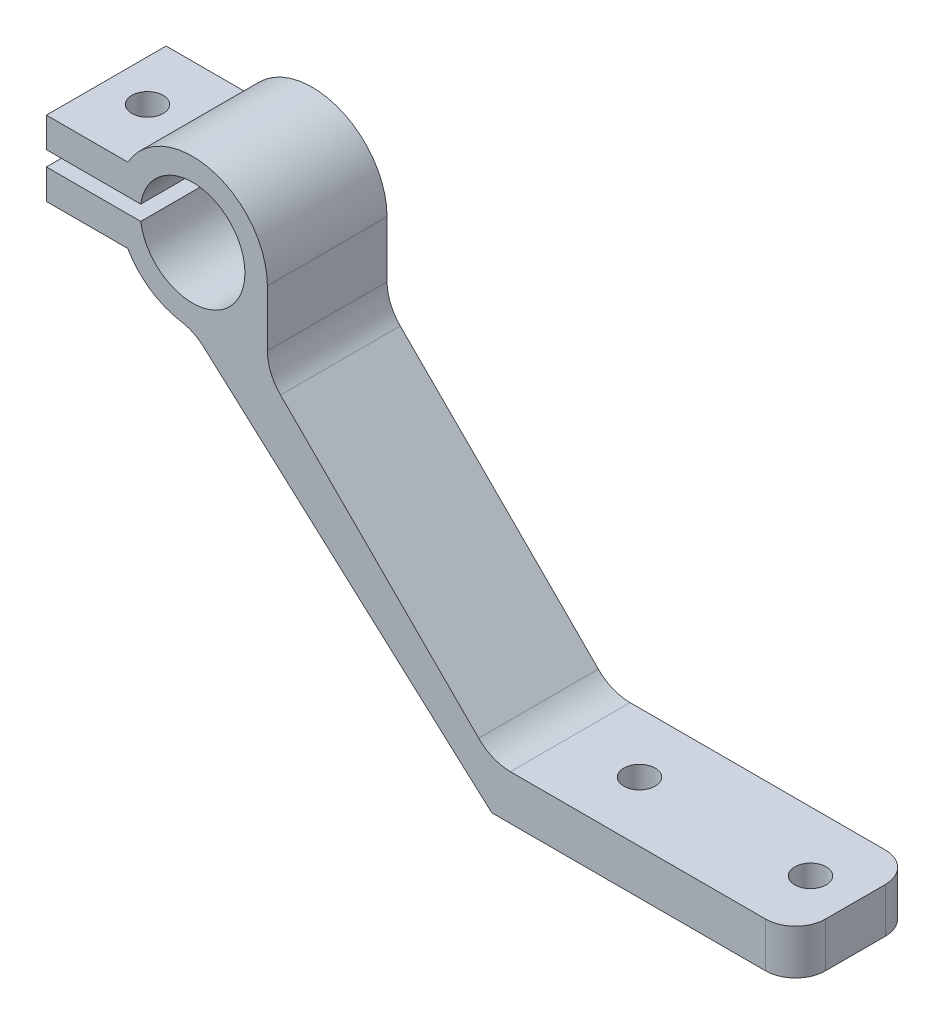
ISO-10303-21;
HEADER;
FILE_DESCRIPTION(('STEP AP214'),'2;1');
FILE_NAME('part.step','',(''),(''),'','','');
FILE_SCHEMA(('AUTOMOTIVE_DESIGN { 1 0 10303 214 1 1 1 1 }'));
ENDSEC;
DATA;
#1=APPLICATION_CONTEXT('core data for automotive mechanical design processes');
#2=APPLICATION_PROTOCOL_DEFINITION('international standard','automotive_design',2000,#1);
#3=PRODUCT_CONTEXT('',#1,'mechanical');
#4=PRODUCT('Part','Part','',(#3));
#5=PRODUCT_RELATED_PRODUCT_CATEGORY('part','',(#4));
#6=PRODUCT_DEFINITION_FORMATION('','',#4);
#7=PRODUCT_DEFINITION_CONTEXT('part definition',#1,'design');
#8=PRODUCT_DEFINITION('design','',#6,#7);
#9=PRODUCT_DEFINITION_SHAPE('','',#8);
#10=(LENGTH_UNIT() NAMED_UNIT(*) SI_UNIT(.MILLI.,.METRE.));
#11=(NAMED_UNIT(*) PLANE_ANGLE_UNIT() SI_UNIT($,.RADIAN.));
#12=(NAMED_UNIT(*) SI_UNIT($,.STERADIAN.) SOLID_ANGLE_UNIT());
#13=UNCERTAINTY_MEASURE_WITH_UNIT(LENGTH_MEASURE(1.E-05),#10,'distance_accuracy_value','');
#14=(GEOMETRIC_REPRESENTATION_CONTEXT(3) GLOBAL_UNCERTAINTY_ASSIGNED_CONTEXT((#13)) GLOBAL_UNIT_ASSIGNED_CONTEXT((#10,
#11,#12)) REPRESENTATION_CONTEXT('',''));
#15=CARTESIAN_POINT('',(0.,0.,0.));
#16=DIRECTION('',(0.,0.,1.));
#17=DIRECTION('',(1.,0.,0.));
#18=AXIS2_PLACEMENT_3D('',#15,#16,#17);
#19=CARTESIAN_POINT('',(-38.5942428896594,0.,0.));
#20=DIRECTION('',(0.,1.,0.));
#21=DIRECTION('',(0.,0.,1.));
#22=AXIS2_PLACEMENT_3D('',#19,#20,#21);
#23=CYLINDRICAL_SURFACE('',#22,1.05);
#24=CARTESIAN_POINT('',(-38.5942428896594,22.5,0.));
#25=DIRECTION('',(0.,-1.,0.));
#26=DIRECTION('',(0.,0.,-1.));
#27=AXIS2_PLACEMENT_3D('',#24,#25,#26);
#28=CIRCLE('',#27,1.05);
#29=CARTESIAN_POINT('',(-38.5942428896594,22.5,-1.05));
#30=VERTEX_POINT('',#29);
#31=EDGE_CURVE('E281',#30,#30,#28,.T.);
#32=ORIENTED_EDGE('',*,*,#31,.F.);
#33=EDGE_LOOP('',(#32));
#34=FACE_BOUND('',#33,.T.);
#35=CARTESIAN_POINT('',(-38.5942428896594,21.3,0.));
#36=DIRECTION('',(0.,-1.,0.));
#37=DIRECTION('',(0.,0.,-1.));
#38=AXIS2_PLACEMENT_3D('',#35,#36,#37);
#39=CIRCLE('',#38,1.05);
#40=CARTESIAN_POINT('',(-38.5942428896594,21.3,-1.05));
#41=VERTEX_POINT('',#40);
#42=EDGE_CURVE('E53',#41,#41,#39,.F.);
#43=ORIENTED_EDGE('',*,*,#42,.F.);
#44=EDGE_LOOP('',(#43));
#45=FACE_BOUND('',#44,.T.);
#46=ADVANCED_FACE('F49',(#34,#45),#23,.F.);
#47=CARTESIAN_POINT('',(0.,3.,4.));
#48=DIRECTION('',(0.,0.,-1.));
#49=DIRECTION('',(-1.,0.,0.));
#50=AXIS2_PLACEMENT_3D('',#47,#48,#49);
#51=PLANE('',#50);
#52=DIRECTION('',(1.,0.,0.));
#53=VECTOR('',#52,1.);
#54=CARTESIAN_POINT('',(0.,0.,4.));
#55=LINE('',#54,#53);
#56=CARTESIAN_POINT('',(-11.585,0.,4.));
#57=VERTEX_POINT('',#56);
#58=CARTESIAN_POINT('',(6.71499999999999,0.,4.));
#59=VERTEX_POINT('',#58);
#60=EDGE_CURVE('E497',#57,#59,#55,.T.);
#61=ORIENTED_EDGE('',*,*,#60,.T.);
#62=DIRECTION('',(0.,-1.,0.));
#63=VECTOR('',#62,1.);
#64=CARTESIAN_POINT('',(6.71499999999999,3.,4.));
#65=LINE('',#64,#63);
#66=CARTESIAN_POINT('',(6.71499999999999,3.,4.));
#67=VERTEX_POINT('',#66);
#68=EDGE_CURVE('E469',#67,#59,#65,.T.);
#69=ORIENTED_EDGE('',*,*,#68,.F.);
#70=DIRECTION('',(1.,0.,0.));
#71=VECTOR('',#70,1.);
#72=CARTESIAN_POINT('',(0.,3.,4.));
#73=LINE('',#72,#71);
#74=CARTESIAN_POINT('',(-10.3423593128807,3.,4.));
#75=VERTEX_POINT('',#74);
#76=EDGE_CURVE('E483',#75,#67,#73,.T.);
#77=ORIENTED_EDGE('',*,*,#76,.F.);
#78=CARTESIAN_POINT('',(-10.3423593128807,6.,4.));
#79=DIRECTION('',(0.,0.,-1.));
#80=DIRECTION('',(-1.,0.,0.));
#81=AXIS2_PLACEMENT_3D('',#78,#79,#80);
#82=CIRCLE('',#81,3.);
#83=CARTESIAN_POINT('',(-12.4636796564404,3.87867965644035,4.));
#84=VERTEX_POINT('',#83);
#85=EDGE_CURVE('E58',#75,#84,#82,.T.);
#86=ORIENTED_EDGE('',*,*,#85,.T.);
#87=DIRECTION('',(0.707106781186548,-0.707106781186547,0.));
#88=VECTOR('',#87,1.);
#89=CARTESIAN_POINT('',(-26.585,18.,4.));
#90=LINE('',#89,#88);
#91=CARTESIAN_POINT('',(-25.7063203435596,17.1213203435596,4.));
#92=VERTEX_POINT('',#91);
#93=EDGE_CURVE('E334',#92,#84,#90,.T.);
#94=ORIENTED_EDGE('',*,*,#93,.F.);
#95=CARTESIAN_POINT('',(-23.585,19.2426406871193,4.));
#96=DIRECTION('',(0.,0.,-1.));
#97=DIRECTION('',(-1.,0.,0.));
#98=AXIS2_PLACEMENT_3D('',#95,#96,#97);
#99=CIRCLE('',#98,3.);
#100=CARTESIAN_POINT('',(-26.585,19.2426406871193,4.));
#101=VERTEX_POINT('',#100);
#102=EDGE_CURVE('E376',#92,#101,#99,.T.);
#103=ORIENTED_EDGE('',*,*,#102,.T.);
#104=DIRECTION('',(0.,-1.,0.));
#105=VECTOR('',#104,1.);
#106=CARTESIAN_POINT('',(-26.585,0.,4.));
#107=LINE('',#106,#105);
#108=CARTESIAN_POINT('',(-26.585,23.,4.));
#109=VERTEX_POINT('',#108);
#110=EDGE_CURVE('E285',#109,#101,#107,.T.);
#111=ORIENTED_EDGE('',*,*,#110,.F.);
#112=CARTESIAN_POINT('',(-31.585,23.,4.));
#113=DIRECTION('',(0.,0.,1.));
#114=DIRECTION('',(1.,0.,0.));
#115=AXIS2_PLACEMENT_3D('',#112,#113,#114);
#116=CIRCLE('',#115,5.);
#117=CARTESIAN_POINT('',(-35.9151270189222,25.5,4.));
#118=VERTEX_POINT('',#117);
#119=EDGE_CURVE('E286',#109,#118,#116,.T.);
#120=ORIENTED_EDGE('',*,*,#119,.T.);
#121=DIRECTION('',(1.,0.,0.));
#122=VECTOR('',#121,1.);
#123=CARTESIAN_POINT('',(0.,25.5,4.));
#124=LINE('',#123,#122);
#125=CARTESIAN_POINT('',(-41.3546960070847,25.5,4.));
#126=VERTEX_POINT('',#125);
#127=EDGE_CURVE('E289',#126,#118,#124,.T.);
#128=ORIENTED_EDGE('',*,*,#127,.F.);
#129=DIRECTION('',(0.,1.,0.));
#130=VECTOR('',#129,1.);
#131=CARTESIAN_POINT('',(-41.3546960070847,0.,4.));
#132=LINE('',#131,#130);
#133=CARTESIAN_POINT('',(-41.3546960070847,23.5,4.));
#134=VERTEX_POINT('',#133);
#135=EDGE_CURVE('E292',#134,#126,#132,.T.);
#136=ORIENTED_EDGE('',*,*,#135,.F.);
#137=DIRECTION('',(1.,0.,0.));
#138=VECTOR('',#137,1.);
#139=CARTESIAN_POINT('',(0.,23.5,4.));
#140=LINE('',#139,#138);
#141=CARTESIAN_POINT('',(-35.0491016151378,23.5,4.));
#142=VERTEX_POINT('',#141);
#143=EDGE_CURVE('E295',#134,#142,#140,.T.);
#144=ORIENTED_EDGE('',*,*,#143,.T.);
#145=CARTESIAN_POINT('',(-31.585,23.,4.));
#146=DIRECTION('',(0.,0.,1.));
#147=DIRECTION('',(1.,0.,0.));
#148=AXIS2_PLACEMENT_3D('',#145,#146,#147);
#149=CIRCLE('',#148,3.5);
#150=CARTESIAN_POINT('',(-35.0491016151378,22.5,4.));
#151=VERTEX_POINT('',#150);
#152=EDGE_CURVE('E298',#151,#142,#149,.T.);
#153=ORIENTED_EDGE('',*,*,#152,.F.);
#154=DIRECTION('',(1.,0.,0.));
#155=VECTOR('',#154,1.);
#156=CARTESIAN_POINT('',(0.,22.5,4.));
#157=LINE('',#156,#155);
#158=CARTESIAN_POINT('',(-41.3546960070847,22.5,4.));
#159=VERTEX_POINT('',#158);
#160=EDGE_CURVE('E301',#159,#151,#157,.T.);
#161=ORIENTED_EDGE('',*,*,#160,.F.);
#162=DIRECTION('',(0.,1.,0.));
#163=VECTOR('',#162,1.);
#164=CARTESIAN_POINT('',(-41.3546960070847,0.,4.));
#165=LINE('',#164,#163);
#166=CARTESIAN_POINT('',(-41.3546960070847,20.5,4.));
#167=VERTEX_POINT('',#166);
#168=EDGE_CURVE('E304',#167,#159,#165,.T.);
#169=ORIENTED_EDGE('',*,*,#168,.F.);
#170=DIRECTION('',(1.,0.,0.));
#171=VECTOR('',#170,1.);
#172=CARTESIAN_POINT('',(0.,20.5,4.));
#173=LINE('',#172,#171);
#174=CARTESIAN_POINT('',(-35.9151270189222,20.5,4.));
#175=VERTEX_POINT('',#174);
#176=EDGE_CURVE('E307',#167,#175,#173,.T.);
#177=ORIENTED_EDGE('',*,*,#176,.T.);
#178=CARTESIAN_POINT('',(-31.585,23.,4.));
#179=DIRECTION('',(0.,0.,1.));
#180=DIRECTION('',(1.,0.,0.));
#181=AXIS2_PLACEMENT_3D('',#178,#179,#180);
#182=CIRCLE('',#181,5.);
#183=CARTESIAN_POINT('',(-32.3741338080708,18.0626659184374,4.));
#184=VERTEX_POINT('',#183);
#185=EDGE_CURVE('E310',#175,#184,#182,.T.);
#186=ORIENTED_EDGE('',*,*,#185,.T.);
#187=CARTESIAN_POINT('',(-32.8476140929133,15.1002654694998,4.));
#188=DIRECTION('',(0.,0.,-1.));
#189=DIRECTION('',(-1.,0.,0.));
#190=AXIS2_PLACEMENT_3D('',#187,#188,#189);
#191=CIRCLE('',#190,3.);
#192=CARTESIAN_POINT('',(-30.8407198980459,17.3301479082413,4.));
#193=VERTEX_POINT('',#192);
#194=EDGE_CURVE('E372',#184,#193,#191,.T.);
#195=ORIENTED_EDGE('',*,*,#194,.T.);
#196=DIRECTION('',(0.743294146247166,-0.66896473162245,0.));
#197=VECTOR('',#196,1.);
#198=CARTESIAN_POINT('',(-31.585,18.,4.));
#199=LINE('',#198,#197);
#200=EDGE_CURVE('E359',#193,#57,#199,.T.);
#201=ORIENTED_EDGE('',*,*,#200,.T.);
#202=EDGE_LOOP('',(#61,#69,#77,#86,#94,#103,#111,#120,#128,#136,#144,#153,#161,#169,#177,#186,
#195,#201));
#203=FACE_BOUND('',#202,.T.);
#204=ADVANCED_FACE('F387',(#203),#51,.F.);
#205=CARTESIAN_POINT('',(6.715,3.,2.));
#206=DIRECTION('',(0.,-1.,0.));
#207=DIRECTION('',(0.,0.,-1.));
#208=AXIS2_PLACEMENT_3D('',#205,#206,#207);
#209=CYLINDRICAL_SURFACE('',#208,2.);
#210=CARTESIAN_POINT('',(6.715,0.,2.));
#211=DIRECTION('',(0.,1.,0.));
#212=DIRECTION('',(0.,0.,1.));
#213=AXIS2_PLACEMENT_3D('',#210,#211,#212);
#214=CIRCLE('',#213,2.);
#215=CARTESIAN_POINT('',(8.715,0.,1.99999999999999));
#216=VERTEX_POINT('',#215);
#217=EDGE_CURVE('E498',#59,#216,#214,.T.);
#218=ORIENTED_EDGE('',*,*,#217,.T.);
#219=DIRECTION('',(0.,-1.,0.));
#220=VECTOR('',#219,1.);
#221=CARTESIAN_POINT('',(8.715,3.,1.99999999999999));
#222=LINE('',#221,#220);
#223=CARTESIAN_POINT('',(8.715,3.,1.99999999999999));
#224=VERTEX_POINT('',#223);
#225=EDGE_CURVE('E511',#224,#216,#222,.T.);
#226=ORIENTED_EDGE('',*,*,#225,.F.);
#227=CARTESIAN_POINT('',(6.715,3.,2.));
#228=DIRECTION('',(0.,1.,0.));
#229=DIRECTION('',(0.,0.,1.));
#230=AXIS2_PLACEMENT_3D('',#227,#228,#229);
#231=CIRCLE('',#230,2.);
#232=EDGE_CURVE('E484',#67,#224,#231,.T.);
#233=ORIENTED_EDGE('',*,*,#232,.F.);
#234=ORIENTED_EDGE('',*,*,#68,.T.);
#235=EDGE_LOOP('',(#218,#226,#233,#234));
#236=FACE_BOUND('',#235,.T.);
#237=ADVANCED_FACE('F394',(#236),#209,.T.);
#238=CARTESIAN_POINT('',(8.715,3.,0.));
#239=DIRECTION('',(-1.,0.,0.));
#240=DIRECTION('',(0.,0.,1.));
#241=AXIS2_PLACEMENT_3D('',#238,#239,#240);
#242=PLANE('',#241);
#243=DIRECTION('',(0.,0.,-1.));
#244=VECTOR('',#243,1.);
#245=CARTESIAN_POINT('',(8.715,0.,0.));
#246=LINE('',#245,#244);
#247=CARTESIAN_POINT('',(8.715,0.,-1.99999999999999));
#248=VERTEX_POINT('',#247);
#249=EDGE_CURVE('E500',#216,#248,#246,.T.);
#250=ORIENTED_EDGE('',*,*,#249,.T.);
#251=DIRECTION('',(0.,-1.,0.));
#252=VECTOR('',#251,1.);
#253=CARTESIAN_POINT('',(8.715,3.,-1.99999999999999));
#254=LINE('',#253,#252);
#255=CARTESIAN_POINT('',(8.715,3.,-1.99999999999999));
#256=VERTEX_POINT('',#255);
#257=EDGE_CURVE('E509',#256,#248,#254,.T.);
#258=ORIENTED_EDGE('',*,*,#257,.F.);
#259=DIRECTION('',(0.,0.,-1.));
#260=VECTOR('',#259,1.);
#261=CARTESIAN_POINT('',(8.715,3.,0.));
#262=LINE('',#261,#260);
#263=EDGE_CURVE('E486',#224,#256,#262,.T.);
#264=ORIENTED_EDGE('',*,*,#263,.F.);
#265=ORIENTED_EDGE('',*,*,#225,.T.);
#266=EDGE_LOOP('',(#250,#258,#264,#265));
#267=FACE_BOUND('',#266,.T.);
#268=ADVANCED_FACE('F543',(#267),#242,.F.);
#269=CARTESIAN_POINT('',(6.715,3.,-2.));
#270=DIRECTION('',(0.,-1.,0.));
#271=DIRECTION('',(0.,0.,-1.));
#272=AXIS2_PLACEMENT_3D('',#269,#270,#271);
#273=CYLINDRICAL_SURFACE('',#272,2.);
#274=CARTESIAN_POINT('',(6.715,0.,-2.));
#275=DIRECTION('',(0.,1.,0.));
#276=DIRECTION('',(0.,0.,1.));
#277=AXIS2_PLACEMENT_3D('',#274,#275,#276);
#278=CIRCLE('',#277,2.);
#279=CARTESIAN_POINT('',(6.71499999999999,0.,-4.));
#280=VERTEX_POINT('',#279);
#281=EDGE_CURVE('E503',#280,#248,#278,.F.);
#282=ORIENTED_EDGE('',*,*,#281,.F.);
#283=DIRECTION('',(0.,-1.,0.));
#284=VECTOR('',#283,1.);
#285=CARTESIAN_POINT('',(6.71499999999999,3.,-4.));
#286=LINE('',#285,#284);
#287=CARTESIAN_POINT('',(6.71499999999999,3.,-4.));
#288=VERTEX_POINT('',#287);
#289=EDGE_CURVE('E507',#288,#280,#286,.T.);
#290=ORIENTED_EDGE('',*,*,#289,.F.);
#291=CARTESIAN_POINT('',(6.715,3.,-2.));
#292=DIRECTION('',(0.,1.,0.));
#293=DIRECTION('',(0.,0.,1.));
#294=AXIS2_PLACEMENT_3D('',#291,#292,#293);
#295=CIRCLE('',#294,2.);
#296=EDGE_CURVE('E488',#288,#256,#295,.F.);
#297=ORIENTED_EDGE('',*,*,#296,.T.);
#298=ORIENTED_EDGE('',*,*,#257,.T.);
#299=EDGE_LOOP('',(#282,#290,#297,#298));
#300=FACE_BOUND('',#299,.T.);
#301=ADVANCED_FACE('F538',(#300),#273,.T.);
#302=CARTESIAN_POINT('',(0.,3.,-4.));
#303=DIRECTION('',(0.,0.,-1.));
#304=DIRECTION('',(-1.,0.,0.));
#305=AXIS2_PLACEMENT_3D('',#302,#303,#304);
#306=PLANE('',#305);
#307=DIRECTION('',(1.,0.,0.));
#308=VECTOR('',#307,1.);
#309=CARTESIAN_POINT('',(0.,0.,-4.));
#310=LINE('',#309,#308);
#311=CARTESIAN_POINT('',(-11.585,0.,-4.));
#312=VERTEX_POINT('',#311);
#313=EDGE_CURVE('E506',#312,#280,#310,.T.);
#314=ORIENTED_EDGE('',*,*,#313,.F.);
#315=DIRECTION('',(0.743294146247166,-0.66896473162245,0.));
#316=VECTOR('',#315,1.);
#317=CARTESIAN_POINT('',(-31.585,18.,-4.));
#318=LINE('',#317,#316);
#319=CARTESIAN_POINT('',(-30.8407198980459,17.3301479082413,-4.));
#320=VERTEX_POINT('',#319);
#321=EDGE_CURVE('E470',#320,#312,#318,.T.);
#322=ORIENTED_EDGE('',*,*,#321,.F.);
#323=CARTESIAN_POINT('',(-32.8476140929133,15.1002654694998,-4.));
#324=DIRECTION('',(0.,0.,-1.));
#325=DIRECTION('',(-1.,0.,0.));
#326=AXIS2_PLACEMENT_3D('',#323,#324,#325);
#327=CIRCLE('',#326,3.);
#328=CARTESIAN_POINT('',(-32.3741338080708,18.0626659184374,-4.));
#329=VERTEX_POINT('',#328);
#330=EDGE_CURVE('E374',#320,#329,#327,.F.);
#331=ORIENTED_EDGE('',*,*,#330,.T.);
#332=CARTESIAN_POINT('',(-31.585,23.,-4.));
#333=DIRECTION('',(0.,0.,1.));
#334=DIRECTION('',(1.,0.,0.));
#335=AXIS2_PLACEMENT_3D('',#332,#333,#334);
#336=CIRCLE('',#335,5.);
#337=CARTESIAN_POINT('',(-35.9151270189222,20.5,-4.));
#338=VERTEX_POINT('',#337);
#339=EDGE_CURVE('E331',#338,#329,#336,.T.);
#340=ORIENTED_EDGE('',*,*,#339,.F.);
#341=DIRECTION('',(1.,0.,0.));
#342=VECTOR('',#341,1.);
#343=CARTESIAN_POINT('',(0.,20.5,-4.));
#344=LINE('',#343,#342);
#345=CARTESIAN_POINT('',(-41.3546960070847,20.5,-4.));
#346=VERTEX_POINT('',#345);
#347=EDGE_CURVE('E328',#346,#338,#344,.T.);
#348=ORIENTED_EDGE('',*,*,#347,.F.);
#349=DIRECTION('',(0.,1.,0.));
#350=VECTOR('',#349,1.);
#351=CARTESIAN_POINT('',(-41.3546960070847,0.,-4.));
#352=LINE('',#351,#350);
#353=CARTESIAN_POINT('',(-41.3546960070847,22.5,-4.));
#354=VERTEX_POINT('',#353);
#355=EDGE_CURVE('E326',#346,#354,#352,.T.);
#356=ORIENTED_EDGE('',*,*,#355,.T.);
#357=DIRECTION('',(1.,0.,0.));
#358=VECTOR('',#357,1.);
#359=CARTESIAN_POINT('',(0.,22.5,-4.));
#360=LINE('',#359,#358);
#361=CARTESIAN_POINT('',(-35.0491016151378,22.5,-4.));
#362=VERTEX_POINT('',#361);
#363=EDGE_CURVE('E324',#354,#362,#360,.T.);
#364=ORIENTED_EDGE('',*,*,#363,.T.);
#365=CARTESIAN_POINT('',(-31.585,23.,-4.));
#366=DIRECTION('',(0.,0.,1.));
#367=DIRECTION('',(1.,0.,0.));
#368=AXIS2_PLACEMENT_3D('',#365,#366,#367);
#369=CIRCLE('',#368,3.5);
#370=CARTESIAN_POINT('',(-35.0491016151378,23.5,-4.));
#371=VERTEX_POINT('',#370);
#372=EDGE_CURVE('E322',#362,#371,#369,.T.);
#373=ORIENTED_EDGE('',*,*,#372,.T.);
#374=DIRECTION('',(1.,0.,0.));
#375=VECTOR('',#374,1.);
#376=CARTESIAN_POINT('',(0.,23.5,-4.));
#377=LINE('',#376,#375);
#378=CARTESIAN_POINT('',(-41.3546960070847,23.5,-4.));
#379=VERTEX_POINT('',#378);
#380=EDGE_CURVE('E319',#379,#371,#377,.T.);
#381=ORIENTED_EDGE('',*,*,#380,.F.);
#382=DIRECTION('',(0.,1.,0.));
#383=VECTOR('',#382,1.);
#384=CARTESIAN_POINT('',(-41.3546960070847,0.,-4.));
#385=LINE('',#384,#383);
#386=CARTESIAN_POINT('',(-41.3546960070847,25.5,-4.));
#387=VERTEX_POINT('',#386);
#388=EDGE_CURVE('E317',#379,#387,#385,.T.);
#389=ORIENTED_EDGE('',*,*,#388,.T.);
#390=DIRECTION('',(1.,0.,0.));
#391=VECTOR('',#390,1.);
#392=CARTESIAN_POINT('',(0.,25.5,-4.));
#393=LINE('',#392,#391);
#394=CARTESIAN_POINT('',(-35.9151270189222,25.5,-4.));
#395=VERTEX_POINT('',#394);
#396=EDGE_CURVE('E314',#387,#395,#393,.T.);
#397=ORIENTED_EDGE('',*,*,#396,.T.);
#398=CARTESIAN_POINT('',(-31.585,23.,-4.));
#399=DIRECTION('',(0.,0.,1.));
#400=DIRECTION('',(1.,0.,0.));
#401=AXIS2_PLACEMENT_3D('',#398,#399,#400);
#402=CIRCLE('',#401,5.);
#403=CARTESIAN_POINT('',(-26.585,23.,-4.));
#404=VERTEX_POINT('',#403);
#405=EDGE_CURVE('E311',#404,#395,#402,.T.);
#406=ORIENTED_EDGE('',*,*,#405,.F.);
#407=DIRECTION('',(0.,-1.,0.));
#408=VECTOR('',#407,1.);
#409=CARTESIAN_POINT('',(-26.585,0.,-4.));
#410=LINE('',#409,#408);
#411=CARTESIAN_POINT('',(-26.585,19.2426406871193,-4.));
#412=VERTEX_POINT('',#411);
#413=EDGE_CURVE('E315',#404,#412,#410,.T.);
#414=ORIENTED_EDGE('',*,*,#413,.T.);
#415=CARTESIAN_POINT('',(-23.585,19.2426406871193,-4.));
#416=DIRECTION('',(0.,0.,-1.));
#417=DIRECTION('',(-1.,0.,0.));
#418=AXIS2_PLACEMENT_3D('',#415,#416,#417);
#419=CIRCLE('',#418,3.);
#420=CARTESIAN_POINT('',(-25.7063203435596,17.1213203435596,-4.));
#421=VERTEX_POINT('',#420);
#422=EDGE_CURVE('E378',#412,#421,#419,.F.);
#423=ORIENTED_EDGE('',*,*,#422,.T.);
#424=DIRECTION('',(0.707106781186548,-0.707106781186547,0.));
#425=VECTOR('',#424,1.);
#426=CARTESIAN_POINT('',(-26.585,18.,-4.));
#427=LINE('',#426,#425);
#428=CARTESIAN_POINT('',(-12.4636796564404,3.87867965644036,-4.));
#429=VERTEX_POINT('',#428);
#430=EDGE_CURVE('E356',#421,#429,#427,.T.);
#431=ORIENTED_EDGE('',*,*,#430,.T.);
#432=CARTESIAN_POINT('',(-10.3423593128807,6.,-4.));
#433=DIRECTION('',(0.,0.,-1.));
#434=DIRECTION('',(-1.,0.,0.));
#435=AXIS2_PLACEMENT_3D('',#432,#433,#434);
#436=CIRCLE('',#435,3.);
#437=CARTESIAN_POINT('',(-10.3423593128807,3.,-4.));
#438=VERTEX_POINT('',#437);
#439=EDGE_CURVE('E12',#429,#438,#436,.F.);
#440=ORIENTED_EDGE('',*,*,#439,.T.);
#441=DIRECTION('',(1.,0.,0.));
#442=VECTOR('',#441,1.);
#443=CARTESIAN_POINT('',(0.,3.,-4.));
#444=LINE('',#443,#442);
#445=EDGE_CURVE('E491',#438,#288,#444,.T.);
#446=ORIENTED_EDGE('',*,*,#445,.T.);
#447=ORIENTED_EDGE('',*,*,#289,.T.);
#448=EDGE_LOOP('',(#314,#322,#331,#340,#348,#356,#364,#373,#381,#389,#397,#406,#414,#423,#431,
#440,#446,#447));
#449=FACE_BOUND('',#448,.T.);
#450=ADVANCED_FACE('F534',(#449),#306,.T.);
#451=CARTESIAN_POINT('',(-5.715,3.,0.));
#452=DIRECTION('',(0.,-1.,0.));
#453=DIRECTION('',(0.,0.,-1.));
#454=AXIS2_PLACEMENT_3D('',#451,#452,#453);
#455=CYLINDRICAL_SURFACE('',#454,1.05);
#456=CARTESIAN_POINT('',(-5.715,3.,0.));
#457=DIRECTION('',(0.,1.,0.));
#458=DIRECTION('',(0.,0.,1.));
#459=AXIS2_PLACEMENT_3D('',#456,#457,#458);
#460=CIRCLE('',#459,1.05);
#461=CARTESIAN_POINT('',(-5.715,3.,1.05));
#462=VERTEX_POINT('',#461);
#463=EDGE_CURVE('E480',#462,#462,#460,.T.);
#464=ORIENTED_EDGE('',*,*,#463,.T.);
#465=EDGE_LOOP('',(#464));
#466=FACE_BOUND('',#465,.T.);
#467=CARTESIAN_POINT('',(-5.715,0.,0.));
#468=DIRECTION('',(0.,1.,0.));
#469=DIRECTION('',(0.,0.,1.));
#470=AXIS2_PLACEMENT_3D('',#467,#468,#469);
#471=CIRCLE('',#470,1.05);
#472=CARTESIAN_POINT('',(-5.715,0.,1.05));
#473=VERTEX_POINT('',#472);
#474=EDGE_CURVE('E494',#473,#473,#471,.T.);
#475=ORIENTED_EDGE('',*,*,#474,.F.);
#476=EDGE_LOOP('',(#475));
#477=FACE_BOUND('',#476,.T.);
#478=ADVANCED_FACE('F588',(#466,#477),#455,.F.);
#479=CARTESIAN_POINT('',(5.715,3.,0.));
#480=DIRECTION('',(0.,-1.,0.));
#481=DIRECTION('',(0.,0.,-1.));
#482=AXIS2_PLACEMENT_3D('',#479,#480,#481);
#483=CYLINDRICAL_SURFACE('',#482,1.05);
#484=CARTESIAN_POINT('',(5.715,3.,0.));
#485=DIRECTION('',(0.,1.,0.));
#486=DIRECTION('',(0.,0.,1.));
#487=AXIS2_PLACEMENT_3D('',#484,#485,#486);
#488=CIRCLE('',#487,1.05);
#489=CARTESIAN_POINT('',(5.715,3.,1.05));
#490=VERTEX_POINT('',#489);
#491=EDGE_CURVE('E477',#490,#490,#488,.T.);
#492=ORIENTED_EDGE('',*,*,#491,.T.);
#493=EDGE_LOOP('',(#492));
#494=FACE_BOUND('',#493,.T.);
#495=CARTESIAN_POINT('',(5.715,0.,0.));
#496=DIRECTION('',(0.,1.,0.));
#497=DIRECTION('',(0.,0.,1.));
#498=AXIS2_PLACEMENT_3D('',#495,#496,#497);
#499=CIRCLE('',#498,1.05);
#500=CARTESIAN_POINT('',(5.715,0.,1.05));
#501=VERTEX_POINT('',#500);
#502=EDGE_CURVE('E472',#501,#501,#499,.T.);
#503=ORIENTED_EDGE('',*,*,#502,.F.);
#504=EDGE_LOOP('',(#503));
#505=FACE_BOUND('',#504,.T.);
#506=ADVANCED_FACE('F585',(#494,#505),#483,.F.);
#507=CARTESIAN_POINT('',(0.,3.,0.));
#508=DIRECTION('',(0.,1.,0.));
#509=DIRECTION('',(0.,0.,1.));
#510=AXIS2_PLACEMENT_3D('',#507,#508,#509);
#511=PLANE('',#510);
#512=ORIENTED_EDGE('',*,*,#491,.F.);
#513=EDGE_LOOP('',(#512));
#514=FACE_BOUND('',#513,.T.);
#515=ORIENTED_EDGE('',*,*,#463,.F.);
#516=EDGE_LOOP('',(#515));
#517=FACE_BOUND('',#516,.T.);
#518=ORIENTED_EDGE('',*,*,#445,.F.);
#519=DIRECTION('',(0.,0.,1.));
#520=VECTOR('',#519,1.);
#521=CARTESIAN_POINT('',(-10.3423593128807,3.,0.));
#522=LINE('',#521,#520);
#523=EDGE_CURVE('E369',#438,#75,#522,.T.);
#524=ORIENTED_EDGE('',*,*,#523,.T.);
#525=ORIENTED_EDGE('',*,*,#76,.T.);
#526=ORIENTED_EDGE('',*,*,#232,.T.);
#527=ORIENTED_EDGE('',*,*,#263,.T.);
#528=ORIENTED_EDGE('',*,*,#296,.F.);
#529=EDGE_LOOP('',(#518,#524,#525,#526,#527,#528));
#530=FACE_BOUND('',#529,.T.);
#531=ADVANCED_FACE('F548',(#514,#517,#530),#511,.T.);
#532=CARTESIAN_POINT('',(0.,0.,0.));
#533=DIRECTION('',(0.,1.,0.));
#534=DIRECTION('',(0.,0.,1.));
#535=AXIS2_PLACEMENT_3D('',#532,#533,#534);
#536=PLANE('',#535);
#537=ORIENTED_EDGE('',*,*,#502,.T.);
#538=EDGE_LOOP('',(#537));
#539=FACE_BOUND('',#538,.T.);
#540=ORIENTED_EDGE('',*,*,#474,.T.);
#541=EDGE_LOOP('',(#540));
#542=FACE_BOUND('',#541,.T.);
#543=ORIENTED_EDGE('',*,*,#60,.F.);
#544=DIRECTION('',(0.,0.,1.));
#545=VECTOR('',#544,1.);
#546=CARTESIAN_POINT('',(-11.585,0.,0.));
#547=LINE('',#546,#545);
#548=EDGE_CURVE('E455',#312,#57,#547,.T.);
#549=ORIENTED_EDGE('',*,*,#548,.F.);
#550=ORIENTED_EDGE('',*,*,#313,.T.);
#551=ORIENTED_EDGE('',*,*,#281,.T.);
#552=ORIENTED_EDGE('',*,*,#249,.F.);
#553=ORIENTED_EDGE('',*,*,#217,.F.);
#554=EDGE_LOOP('',(#543,#549,#550,#551,#552,#553));
#555=FACE_BOUND('',#554,.T.);
#556=ADVANCED_FACE('F526',(#539,#542,#555),#536,.F.);
#557=CARTESIAN_POINT('',(-4.2925,-4.2925,0.));
#558=DIRECTION('',(-0.707106781186547,-0.707106781186548,0.));
#559=DIRECTION('',(0.707106781186548,-0.707106781186547,0.));
#560=AXIS2_PLACEMENT_3D('',#557,#558,#559);
#561=PLANE('',#560);
#562=ORIENTED_EDGE('',*,*,#430,.F.);
#563=DIRECTION('',(0.,0.,1.));
#564=VECTOR('',#563,1.);
#565=CARTESIAN_POINT('',(-25.7063203435596,17.1213203435596,4.));
#566=LINE('',#565,#564);
#567=EDGE_CURVE('E363',#421,#92,#566,.T.);
#568=ORIENTED_EDGE('',*,*,#567,.T.);
#569=ORIENTED_EDGE('',*,*,#93,.T.);
#570=DIRECTION('',(0.,0.,1.));
#571=VECTOR('',#570,1.);
#572=CARTESIAN_POINT('',(-12.4636796564404,3.87867965644036,0.));
#573=LINE('',#572,#571);
#574=EDGE_CURVE('E361',#84,#429,#573,.F.);
#575=ORIENTED_EDGE('',*,*,#574,.T.);
#576=EDGE_LOOP('',(#562,#568,#569,#575));
#577=FACE_BOUND('',#576,.T.);
#578=ADVANCED_FACE('F555',(#577),#561,.F.);
#579=CARTESIAN_POINT('',(-5.18444751381215,-5.76049723756906,0.));
#580=DIRECTION('',(-0.66896473162245,-0.743294146247166,0.));
#581=DIRECTION('',(0.743294146247166,-0.66896473162245,0.));
#582=AXIS2_PLACEMENT_3D('',#579,#580,#581);
#583=PLANE('',#582);
#584=ORIENTED_EDGE('',*,*,#200,.F.);
#585=DIRECTION('',(0.,0.,-1.));
#586=VECTOR('',#585,1.);
#587=CARTESIAN_POINT('',(-30.8407198980459,17.3301479082413,-4.));
#588=LINE('',#587,#586);
#589=EDGE_CURVE('E364',#193,#320,#588,.T.);
#590=ORIENTED_EDGE('',*,*,#589,.T.);
#591=ORIENTED_EDGE('',*,*,#321,.T.);
#592=ORIENTED_EDGE('',*,*,#548,.T.);
#593=EDGE_LOOP('',(#584,#590,#591,#592));
#594=FACE_BOUND('',#593,.T.);
#595=ADVANCED_FACE('F529',(#594),#583,.T.);
#596=CARTESIAN_POINT('',(-26.585,0.,-4.));
#597=DIRECTION('',(-1.,0.,0.));
#598=DIRECTION('',(0.,-1.,0.));
#599=AXIS2_PLACEMENT_3D('',#596,#597,#598);
#600=PLANE('',#599);
#601=ORIENTED_EDGE('',*,*,#110,.T.);
#602=DIRECTION('',(0.,0.,1.));
#603=VECTOR('',#602,1.);
#604=CARTESIAN_POINT('',(-26.585,19.2426406871193,-4.));
#605=LINE('',#604,#603);
#606=EDGE_CURVE('E367',#101,#412,#605,.F.);
#607=ORIENTED_EDGE('',*,*,#606,.T.);
#608=ORIENTED_EDGE('',*,*,#413,.F.);
#609=DIRECTION('',(0.,0.,1.));
#610=VECTOR('',#609,1.);
#611=CARTESIAN_POINT('',(-26.585,23.,-4.));
#612=LINE('',#611,#610);
#613=EDGE_CURVE('E349',#404,#109,#612,.T.);
#614=ORIENTED_EDGE('',*,*,#613,.T.);
#615=EDGE_LOOP('',(#601,#607,#608,#614));
#616=FACE_BOUND('',#615,.T.);
#617=ADVANCED_FACE('F562',(#616),#600,.F.);
#618=CARTESIAN_POINT('',(-31.585,23.,-4.));
#619=DIRECTION('',(0.,0.,1.));
#620=DIRECTION('',(1.,0.,0.));
#621=AXIS2_PLACEMENT_3D('',#618,#619,#620);
#622=CYLINDRICAL_SURFACE('',#621,5.);
#623=ORIENTED_EDGE('',*,*,#339,.T.);
#624=DIRECTION('',(0.,0.,1.));
#625=VECTOR('',#624,1.);
#626=CARTESIAN_POINT('',(-32.3741338080708,18.0626659184374,-4.));
#627=LINE('',#626,#625);
#628=EDGE_CURVE('E449',#329,#184,#627,.T.);
#629=ORIENTED_EDGE('',*,*,#628,.T.);
#630=ORIENTED_EDGE('',*,*,#185,.F.);
#631=DIRECTION('',(0.,0.,1.));
#632=VECTOR('',#631,1.);
#633=CARTESIAN_POINT('',(-35.9151270189222,20.5,-4.));
#634=LINE('',#633,#632);
#635=EDGE_CURVE('E332',#338,#175,#634,.T.);
#636=ORIENTED_EDGE('',*,*,#635,.F.);
#637=EDGE_LOOP('',(#623,#629,#630,#636));
#638=FACE_BOUND('',#637,.T.);
#639=ADVANCED_FACE('F446',(#638),#622,.T.);
#640=CARTESIAN_POINT('',(0.,20.5,-4.));
#641=DIRECTION('',(0.,-1.,0.));
#642=DIRECTION('',(0.,0.,-1.));
#643=AXIS2_PLACEMENT_3D('',#640,#641,#642);
#644=PLANE('',#643);
#645=DIRECTION('',(0.,0.,1.));
#646=VECTOR('',#645,1.);
#647=CARTESIAN_POINT('',(-36.5942428896594,20.5,-1.15470053837925));
#648=LINE('',#647,#646);
#649=CARTESIAN_POINT('',(-36.5942428896594,20.5,-1.15470053837925));
#650=VERTEX_POINT('',#649);
#651=CARTESIAN_POINT('',(-36.5942428896594,20.5,1.15470053837925));
#652=VERTEX_POINT('',#651);
#653=EDGE_CURVE('E66',#650,#652,#648,.T.);
#654=ORIENTED_EDGE('',*,*,#653,.F.);
#655=DIRECTION('',(0.866025403784439,0.,0.5));
#656=VECTOR('',#655,1.);
#657=CARTESIAN_POINT('',(-38.5942428896594,20.5,-2.3094010767585));
#658=LINE('',#657,#656);
#659=CARTESIAN_POINT('',(-38.5942428896594,20.5,-2.3094010767585));
#660=VERTEX_POINT('',#659);
#661=EDGE_CURVE('E245',#660,#650,#658,.T.);
#662=ORIENTED_EDGE('',*,*,#661,.F.);
#663=DIRECTION('',(0.866025403784439,0.,-0.5));
#664=VECTOR('',#663,1.);
#665=CARTESIAN_POINT('',(-40.5942428896594,20.5,-1.15470053837925));
#666=LINE('',#665,#664);
#667=CARTESIAN_POINT('',(-40.5942428896594,20.5,-1.15470053837925));
#668=VERTEX_POINT('',#667);
#669=EDGE_CURVE('E248',#668,#660,#666,.T.);
#670=ORIENTED_EDGE('',*,*,#669,.F.);
#671=DIRECTION('',(0.,0.,-1.));
#672=VECTOR('',#671,1.);
#673=CARTESIAN_POINT('',(-40.5942428896594,20.5,1.15470053837925));
#674=LINE('',#673,#672);
#675=CARTESIAN_POINT('',(-40.5942428896594,20.5,1.15470053837925));
#676=VERTEX_POINT('',#675);
#677=EDGE_CURVE('E264',#676,#668,#674,.T.);
#678=ORIENTED_EDGE('',*,*,#677,.F.);
#679=DIRECTION('',(-0.866025403784439,0.,-0.5));
#680=VECTOR('',#679,1.);
#681=CARTESIAN_POINT('',(-38.5942428896594,20.5,2.3094010767585));
#682=LINE('',#681,#680);
#683=CARTESIAN_POINT('',(-38.5942428896594,20.5,2.3094010767585));
#684=VERTEX_POINT('',#683);
#685=EDGE_CURVE('E261',#684,#676,#682,.T.);
#686=ORIENTED_EDGE('',*,*,#685,.F.);
#687=DIRECTION('',(-0.866025403784439,0.,0.5));
#688=VECTOR('',#687,1.);
#689=CARTESIAN_POINT('',(-36.5942428896594,20.5,1.15470053837925));
#690=LINE('',#689,#688);
#691=EDGE_CURVE('E259',#652,#684,#690,.T.);
#692=ORIENTED_EDGE('',*,*,#691,.F.);
#693=EDGE_LOOP('',(#654,#662,#670,#678,#686,#692));
#694=FACE_BOUND('',#693,.T.);
#695=ORIENTED_EDGE('',*,*,#635,.T.);
#696=ORIENTED_EDGE('',*,*,#176,.F.);
#697=DIRECTION('',(0.,0.,1.));
#698=VECTOR('',#697,1.);
#699=CARTESIAN_POINT('',(-41.3546960070847,20.5,-4.));
#700=LINE('',#699,#698);
#701=EDGE_CURVE('E335',#346,#167,#700,.T.);
#702=ORIENTED_EDGE('',*,*,#701,.F.);
#703=ORIENTED_EDGE('',*,*,#347,.T.);
#704=EDGE_LOOP('',(#695,#696,#702,#703));
#705=FACE_BOUND('',#704,.T.);
#706=ADVANCED_FACE('F440',(#694,#705),#644,.T.);
#707=CARTESIAN_POINT('',(-41.3546960070847,0.,-4.));
#708=DIRECTION('',(1.,0.,0.));
#709=DIRECTION('',(0.,0.,-1.));
#710=AXIS2_PLACEMENT_3D('',#707,#708,#709);
#711=PLANE('',#710);
#712=ORIENTED_EDGE('',*,*,#701,.T.);
#713=ORIENTED_EDGE('',*,*,#168,.T.);
#714=DIRECTION('',(0.,0.,1.));
#715=VECTOR('',#714,1.);
#716=CARTESIAN_POINT('',(-41.3546960070847,22.5,-4.));
#717=LINE('',#716,#715);
#718=EDGE_CURVE('E337',#354,#159,#717,.T.);
#719=ORIENTED_EDGE('',*,*,#718,.F.);
#720=ORIENTED_EDGE('',*,*,#355,.F.);
#721=EDGE_LOOP('',(#712,#713,#719,#720));
#722=FACE_BOUND('',#721,.T.);
#723=ADVANCED_FACE('F435',(#722),#711,.F.);
#724=CARTESIAN_POINT('',(0.,22.5,-4.));
#725=DIRECTION('',(0.,-1.,0.));
#726=DIRECTION('',(0.,0.,-1.));
#727=AXIS2_PLACEMENT_3D('',#724,#725,#726);
#728=PLANE('',#727);
#729=ORIENTED_EDGE('',*,*,#31,.T.);
#730=EDGE_LOOP('',(#729));
#731=FACE_BOUND('',#730,.T.);
#732=ORIENTED_EDGE('',*,*,#718,.T.);
#733=ORIENTED_EDGE('',*,*,#160,.T.);
#734=DIRECTION('',(0.,0.,1.));
#735=VECTOR('',#734,1.);
#736=CARTESIAN_POINT('',(-35.0491016151378,22.5,-4.));
#737=LINE('',#736,#735);
#738=EDGE_CURVE('E339',#362,#151,#737,.T.);
#739=ORIENTED_EDGE('',*,*,#738,.F.);
#740=ORIENTED_EDGE('',*,*,#363,.F.);
#741=EDGE_LOOP('',(#732,#733,#739,#740));
#742=FACE_BOUND('',#741,.T.);
#743=ADVANCED_FACE('F431',(#731,#742),#728,.F.);
#744=CARTESIAN_POINT('',(-31.585,23.,-4.));
#745=DIRECTION('',(0.,0.,1.));
#746=DIRECTION('',(1.,0.,0.));
#747=AXIS2_PLACEMENT_3D('',#744,#745,#746);
#748=CYLINDRICAL_SURFACE('',#747,3.5);
#749=ORIENTED_EDGE('',*,*,#738,.T.);
#750=ORIENTED_EDGE('',*,*,#152,.T.);
#751=DIRECTION('',(0.,0.,1.));
#752=VECTOR('',#751,1.);
#753=CARTESIAN_POINT('',(-35.0491016151378,23.5,-4.));
#754=LINE('',#753,#752);
#755=EDGE_CURVE('E341',#371,#142,#754,.T.);
#756=ORIENTED_EDGE('',*,*,#755,.F.);
#757=ORIENTED_EDGE('',*,*,#372,.F.);
#758=EDGE_LOOP('',(#749,#750,#756,#757));
#759=FACE_BOUND('',#758,.T.);
#760=ADVANCED_FACE('F416',(#759),#748,.F.);
#761=CARTESIAN_POINT('',(0.,23.5,-4.));
#762=DIRECTION('',(0.,-1.,0.));
#763=DIRECTION('',(0.,0.,-1.));
#764=AXIS2_PLACEMENT_3D('',#761,#762,#763);
#765=PLANE('',#764);
#766=CARTESIAN_POINT('',(-38.5942428896594,23.5,0.));
#767=DIRECTION('',(0.,-1.,0.));
#768=DIRECTION('',(0.,0.,-1.));
#769=AXIS2_PLACEMENT_3D('',#766,#767,#768);
#770=CIRCLE('',#769,1.05);
#771=CARTESIAN_POINT('',(-38.5942428896594,23.5,-1.05));
#772=VERTEX_POINT('',#771);
#773=EDGE_CURVE('E278',#772,#772,#770,.T.);
#774=ORIENTED_EDGE('',*,*,#773,.F.);
#775=EDGE_LOOP('',(#774));
#776=FACE_BOUND('',#775,.T.);
#777=ORIENTED_EDGE('',*,*,#755,.T.);
#778=ORIENTED_EDGE('',*,*,#143,.F.);
#779=DIRECTION('',(0.,0.,1.));
#780=VECTOR('',#779,1.);
#781=CARTESIAN_POINT('',(-41.3546960070847,23.5,-4.));
#782=LINE('',#781,#780);
#783=EDGE_CURVE('E343',#379,#134,#782,.T.);
#784=ORIENTED_EDGE('',*,*,#783,.F.);
#785=ORIENTED_EDGE('',*,*,#380,.T.);
#786=EDGE_LOOP('',(#777,#778,#784,#785));
#787=FACE_BOUND('',#786,.T.);
#788=ADVANCED_FACE('F412',(#776,#787),#765,.T.);
#789=CARTESIAN_POINT('',(-41.3546960070847,0.,-4.));
#790=DIRECTION('',(1.,0.,0.));
#791=DIRECTION('',(0.,0.,-1.));
#792=AXIS2_PLACEMENT_3D('',#789,#790,#791);
#793=PLANE('',#792);
#794=ORIENTED_EDGE('',*,*,#783,.T.);
#795=ORIENTED_EDGE('',*,*,#135,.T.);
#796=DIRECTION('',(0.,0.,1.));
#797=VECTOR('',#796,1.);
#798=CARTESIAN_POINT('',(-41.3546960070847,25.5,-4.));
#799=LINE('',#798,#797);
#800=EDGE_CURVE('E345',#387,#126,#799,.T.);
#801=ORIENTED_EDGE('',*,*,#800,.F.);
#802=ORIENTED_EDGE('',*,*,#388,.F.);
#803=EDGE_LOOP('',(#794,#795,#801,#802));
#804=FACE_BOUND('',#803,.T.);
#805=ADVANCED_FACE('F415',(#804),#793,.F.);
#806=CARTESIAN_POINT('',(0.,25.5,-4.));
#807=DIRECTION('',(0.,-1.,0.));
#808=DIRECTION('',(0.,0.,-1.));
#809=AXIS2_PLACEMENT_3D('',#806,#807,#808);
#810=PLANE('',#809);
#811=CARTESIAN_POINT('',(-38.5942428896594,25.5,0.));
#812=DIRECTION('',(0.,-1.,0.));
#813=DIRECTION('',(0.,0.,-1.));
#814=AXIS2_PLACEMENT_3D('',#811,#812,#813);
#815=CIRCLE('',#814,1.05);
#816=CARTESIAN_POINT('',(-38.5942428896594,25.5,-1.05));
#817=VERTEX_POINT('',#816);
#818=EDGE_CURVE('E282',#817,#817,#815,.T.);
#819=ORIENTED_EDGE('',*,*,#818,.T.);
#820=EDGE_LOOP('',(#819));
#821=FACE_BOUND('',#820,.T.);
#822=ORIENTED_EDGE('',*,*,#800,.T.);
#823=ORIENTED_EDGE('',*,*,#127,.T.);
#824=DIRECTION('',(0.,0.,1.));
#825=VECTOR('',#824,1.);
#826=CARTESIAN_POINT('',(-35.9151270189222,25.5,-4.));
#827=LINE('',#826,#825);
#828=EDGE_CURVE('E347',#395,#118,#827,.T.);
#829=ORIENTED_EDGE('',*,*,#828,.F.);
#830=ORIENTED_EDGE('',*,*,#396,.F.);
#831=EDGE_LOOP('',(#822,#823,#829,#830));
#832=FACE_BOUND('',#831,.T.);
#833=ADVANCED_FACE('F570',(#821,#832),#810,.F.);
#834=CARTESIAN_POINT('',(-31.585,23.,-4.));
#835=DIRECTION('',(0.,0.,1.));
#836=DIRECTION('',(1.,0.,0.));
#837=AXIS2_PLACEMENT_3D('',#834,#835,#836);
#838=CYLINDRICAL_SURFACE('',#837,5.);
#839=ORIENTED_EDGE('',*,*,#828,.T.);
#840=ORIENTED_EDGE('',*,*,#119,.F.);
#841=ORIENTED_EDGE('',*,*,#613,.F.);
#842=ORIENTED_EDGE('',*,*,#405,.T.);
#843=EDGE_LOOP('',(#839,#840,#841,#842));
#844=FACE_BOUND('',#843,.T.);
#845=ADVANCED_FACE('F567',(#844),#838,.T.);
#846=CARTESIAN_POINT('',(-32.8476140929133,15.1002654694998,-4.));
#847=DIRECTION('',(0.,0.,1.));
#848=DIRECTION('',(1.,0.,0.));
#849=AXIS2_PLACEMENT_3D('',#846,#847,#848);
#850=CYLINDRICAL_SURFACE('',#849,3.);
#851=ORIENTED_EDGE('',*,*,#330,.F.);
#852=ORIENTED_EDGE('',*,*,#589,.F.);
#853=ORIENTED_EDGE('',*,*,#194,.F.);
#854=ORIENTED_EDGE('',*,*,#628,.F.);
#855=EDGE_LOOP('',(#851,#852,#853,#854));
#856=FACE_BOUND('',#855,.T.);
#857=ADVANCED_FACE('F576',(#856),#850,.F.);
#858=CARTESIAN_POINT('',(-23.585,19.2426406871193,0.));
#859=DIRECTION('',(0.,0.,-1.));
#860=DIRECTION('',(0.,1.,0.));
#861=AXIS2_PLACEMENT_3D('',#858,#859,#860);
#862=CYLINDRICAL_SURFACE('',#861,3.);
#863=ORIENTED_EDGE('',*,*,#422,.F.);
#864=ORIENTED_EDGE('',*,*,#606,.F.);
#865=ORIENTED_EDGE('',*,*,#102,.F.);
#866=ORIENTED_EDGE('',*,*,#567,.F.);
#867=EDGE_LOOP('',(#863,#864,#865,#866));
#868=FACE_BOUND('',#867,.T.);
#869=ADVANCED_FACE('F407',(#868),#862,.F.);
#870=CARTESIAN_POINT('',(-10.3423593128807,6.,0.));
#871=DIRECTION('',(0.,0.,1.));
#872=DIRECTION('',(1.,0.,0.));
#873=AXIS2_PLACEMENT_3D('',#870,#871,#872);
#874=CYLINDRICAL_SURFACE('',#873,3.);
#875=ORIENTED_EDGE('',*,*,#439,.F.);
#876=ORIENTED_EDGE('',*,*,#574,.F.);
#877=ORIENTED_EDGE('',*,*,#85,.F.);
#878=ORIENTED_EDGE('',*,*,#523,.F.);
#879=EDGE_LOOP('',(#875,#876,#877,#878));
#880=FACE_BOUND('',#879,.T.);
#881=ADVANCED_FACE('F51',(#880),#874,.F.);
#882=ORIENTED_EDGE('',*,*,#773,.T.);
#883=EDGE_LOOP('',(#882));
#884=FACE_BOUND('',#883,.T.);
#885=ORIENTED_EDGE('',*,*,#818,.F.);
#886=EDGE_LOOP('',(#885));
#887=FACE_BOUND('',#886,.T.);
#888=ADVANCED_FACE('F390',(#884,#887),#23,.F.);
#889=CARTESIAN_POINT('',(0.,21.3,0.));
#890=DIRECTION('',(0.,-1.,0.));
#891=DIRECTION('',(0.,0.,-1.));
#892=AXIS2_PLACEMENT_3D('',#889,#890,#891);
#893=PLANE('',#892);
#894=DIRECTION('',(0.,0.,1.));
#895=VECTOR('',#894,1.);
#896=CARTESIAN_POINT('',(-36.5942428896594,21.3,-1.15470053837925));
#897=LINE('',#896,#895);
#898=CARTESIAN_POINT('',(-36.5942428896594,21.3,-1.15470053837925));
#899=VERTEX_POINT('',#898);
#900=CARTESIAN_POINT('',(-36.5942428896594,21.3,1.15470053837925));
#901=VERTEX_POINT('',#900);
#902=EDGE_CURVE('E225',#899,#901,#897,.T.);
#903=ORIENTED_EDGE('',*,*,#902,.T.);
#904=DIRECTION('',(-0.866025403784439,0.,0.5));
#905=VECTOR('',#904,1.);
#906=CARTESIAN_POINT('',(-36.5942428896594,21.3,1.15470053837925));
#907=LINE('',#906,#905);
#908=CARTESIAN_POINT('',(-38.5942428896594,21.3,2.3094010767585));
#909=VERTEX_POINT('',#908);
#910=EDGE_CURVE('E234',#901,#909,#907,.T.);
#911=ORIENTED_EDGE('',*,*,#910,.T.);
#912=DIRECTION('',(-0.866025403784439,0.,-0.5));
#913=VECTOR('',#912,1.);
#914=CARTESIAN_POINT('',(-38.5942428896594,21.3,2.3094010767585));
#915=LINE('',#914,#913);
#916=CARTESIAN_POINT('',(-40.5942428896594,21.3,1.15470053837925));
#917=VERTEX_POINT('',#916);
#918=EDGE_CURVE('E239',#909,#917,#915,.T.);
#919=ORIENTED_EDGE('',*,*,#918,.T.);
#920=DIRECTION('',(0.,0.,-1.));
#921=VECTOR('',#920,1.);
#922=CARTESIAN_POINT('',(-40.5942428896594,21.3,1.15470053837925));
#923=LINE('',#922,#921);
#924=CARTESIAN_POINT('',(-40.5942428896594,21.3,-1.15470053837925));
#925=VERTEX_POINT('',#924);
#926=EDGE_CURVE('E252',#917,#925,#923,.T.);
#927=ORIENTED_EDGE('',*,*,#926,.T.);
#928=DIRECTION('',(0.866025403784439,0.,-0.5));
#929=VECTOR('',#928,1.);
#930=CARTESIAN_POINT('',(-40.5942428896594,21.3,-1.15470053837925));
#931=LINE('',#930,#929);
#932=CARTESIAN_POINT('',(-38.5942428896594,21.3,-2.3094010767585));
#933=VERTEX_POINT('',#932);
#934=EDGE_CURVE('E255',#925,#933,#931,.T.);
#935=ORIENTED_EDGE('',*,*,#934,.T.);
#936=DIRECTION('',(0.866025403784439,0.,0.5));
#937=VECTOR('',#936,1.);
#938=CARTESIAN_POINT('',(-38.5942428896594,21.3,-2.3094010767585));
#939=LINE('',#938,#937);
#940=EDGE_CURVE('E231',#933,#899,#939,.T.);
#941=ORIENTED_EDGE('',*,*,#940,.T.);
#942=EDGE_LOOP('',(#903,#911,#919,#927,#935,#941));
#943=FACE_BOUND('',#942,.T.);
#944=ORIENTED_EDGE('',*,*,#42,.T.);
#945=EDGE_LOOP('',(#944));
#946=FACE_BOUND('',#945,.T.);
#947=ADVANCED_FACE('F241',(#943,#946),#893,.T.);
#948=CARTESIAN_POINT('',(-36.5942428896594,21.3,-1.15470053837925));
#949=DIRECTION('',(1.,0.,0.));
#950=DIRECTION('',(0.,0.,-1.));
#951=AXIS2_PLACEMENT_3D('',#948,#949,#950);
#952=PLANE('',#951);
#953=ORIENTED_EDGE('',*,*,#653,.T.);
#954=DIRECTION('',(0.,-1.,0.));
#955=VECTOR('',#954,1.);
#956=CARTESIAN_POINT('',(-36.5942428896594,21.3,1.15470053837925));
#957=LINE('',#956,#955);
#958=EDGE_CURVE('E221',#901,#652,#957,.T.);
#959=ORIENTED_EDGE('',*,*,#958,.F.);
#960=ORIENTED_EDGE('',*,*,#902,.F.);
#961=DIRECTION('',(0.,-1.,0.));
#962=VECTOR('',#961,1.);
#963=CARTESIAN_POINT('',(-36.5942428896594,21.3,-1.15470053837925));
#964=LINE('',#963,#962);
#965=EDGE_CURVE('E269',#899,#650,#964,.T.);
#966=ORIENTED_EDGE('',*,*,#965,.T.);
#967=EDGE_LOOP('',(#953,#959,#960,#966));
#968=FACE_BOUND('',#967,.T.);
#969=ADVANCED_FACE('F223',(#968),#952,.F.);
#970=CARTESIAN_POINT('',(-38.5942428896594,21.3,-2.3094010767585));
#971=DIRECTION('',(0.5,0.,-0.866025403784439));
#972=DIRECTION('',(-0.866025403784439,0.,-0.5));
#973=AXIS2_PLACEMENT_3D('',#970,#971,#972);
#974=PLANE('',#973);
#975=ORIENTED_EDGE('',*,*,#661,.T.);
#976=ORIENTED_EDGE('',*,*,#965,.F.);
#977=ORIENTED_EDGE('',*,*,#940,.F.);
#978=DIRECTION('',(0.,-1.,0.));
#979=VECTOR('',#978,1.);
#980=CARTESIAN_POINT('',(-38.5942428896594,21.3,-2.3094010767585));
#981=LINE('',#980,#979);
#982=EDGE_CURVE('E271',#933,#660,#981,.T.);
#983=ORIENTED_EDGE('',*,*,#982,.T.);
#984=EDGE_LOOP('',(#975,#976,#977,#983));
#985=FACE_BOUND('',#984,.T.);
#986=ADVANCED_FACE('F822',(#985),#974,.F.);
#987=CARTESIAN_POINT('',(-40.5942428896594,21.3,-1.15470053837925));
#988=DIRECTION('',(-0.5,0.,-0.866025403784439));
#989=DIRECTION('',(-0.866025403784439,0.,0.5));
#990=AXIS2_PLACEMENT_3D('',#987,#988,#989);
#991=PLANE('',#990);
#992=ORIENTED_EDGE('',*,*,#669,.T.);
#993=ORIENTED_EDGE('',*,*,#982,.F.);
#994=ORIENTED_EDGE('',*,*,#934,.F.);
#995=DIRECTION('',(0.,-1.,0.));
#996=VECTOR('',#995,1.);
#997=CARTESIAN_POINT('',(-40.5942428896594,21.3,-1.15470053837925));
#998=LINE('',#997,#996);
#999=EDGE_CURVE('E273',#925,#668,#998,.T.);
#1000=ORIENTED_EDGE('',*,*,#999,.T.);
#1001=EDGE_LOOP('',(#992,#993,#994,#1000));
#1002=FACE_BOUND('',#1001,.T.);
#1003=ADVANCED_FACE('F829',(#1002),#991,.F.);
#1004=CARTESIAN_POINT('',(-40.5942428896594,21.3,1.15470053837925));
#1005=DIRECTION('',(-1.,0.,0.));
#1006=DIRECTION('',(0.,0.,1.));
#1007=AXIS2_PLACEMENT_3D('',#1004,#1005,#1006);
#1008=PLANE('',#1007);
#1009=ORIENTED_EDGE('',*,*,#677,.T.);
#1010=ORIENTED_EDGE('',*,*,#999,.F.);
#1011=ORIENTED_EDGE('',*,*,#926,.F.);
#1012=DIRECTION('',(0.,-1.,0.));
#1013=VECTOR('',#1012,1.);
#1014=CARTESIAN_POINT('',(-40.5942428896594,21.3,1.15470053837925));
#1015=LINE('',#1014,#1013);
#1016=EDGE_CURVE('E275',#917,#676,#1015,.T.);
#1017=ORIENTED_EDGE('',*,*,#1016,.T.);
#1018=EDGE_LOOP('',(#1009,#1010,#1011,#1017));
#1019=FACE_BOUND('',#1018,.T.);
#1020=ADVANCED_FACE('F838',(#1019),#1008,.F.);
#1021=CARTESIAN_POINT('',(-38.5942428896594,21.3,2.3094010767585));
#1022=DIRECTION('',(-0.5,0.,0.866025403784439));
#1023=DIRECTION('',(0.866025403784439,0.,0.5));
#1024=AXIS2_PLACEMENT_3D('',#1021,#1022,#1023);
#1025=PLANE('',#1024);
#1026=ORIENTED_EDGE('',*,*,#685,.T.);
#1027=ORIENTED_EDGE('',*,*,#1016,.F.);
#1028=ORIENTED_EDGE('',*,*,#918,.F.);
#1029=DIRECTION('',(0.,-1.,0.));
#1030=VECTOR('',#1029,1.);
#1031=CARTESIAN_POINT('',(-38.5942428896594,21.3,2.3094010767585));
#1032=LINE('',#1031,#1030);
#1033=EDGE_CURVE('E230',#909,#684,#1032,.T.);
#1034=ORIENTED_EDGE('',*,*,#1033,.T.);
#1035=EDGE_LOOP('',(#1026,#1027,#1028,#1034));
#1036=FACE_BOUND('',#1035,.T.);
#1037=ADVANCED_FACE('F847',(#1036),#1025,.F.);
#1038=CARTESIAN_POINT('',(-36.5942428896594,21.3,1.15470053837925));
#1039=DIRECTION('',(0.5,0.,0.866025403784439));
#1040=DIRECTION('',(0.866025403784439,0.,-0.5));
#1041=AXIS2_PLACEMENT_3D('',#1038,#1039,#1040);
#1042=PLANE('',#1041);
#1043=ORIENTED_EDGE('',*,*,#691,.T.);
#1044=ORIENTED_EDGE('',*,*,#1033,.F.);
#1045=ORIENTED_EDGE('',*,*,#910,.F.);
#1046=ORIENTED_EDGE('',*,*,#958,.T.);
#1047=EDGE_LOOP('',(#1043,#1044,#1045,#1046));
#1048=FACE_BOUND('',#1047,.T.);
#1049=ADVANCED_FACE('F235',(#1048),#1042,.F.);
#1050=CLOSED_SHELL('',(#46,#204,#237,#268,#301,#450,#478,#506,#531,#556,#578,#595,#617,#639,
#706,#723,#743,#760,#788,#805,#833,#845,#857,#869,#881,#888,#947,#969,#986,#1003,#1020,#1037,#1049));
#1051=MANIFOLD_SOLID_BREP('B2',#1050);
#1052=ADVANCED_BREP_SHAPE_REPRESENTATION('',(#18,#1051),#14);
#1053=SHAPE_DEFINITION_REPRESENTATION(#9,#1052);
ENDSEC;
END-ISO-10303-21;
